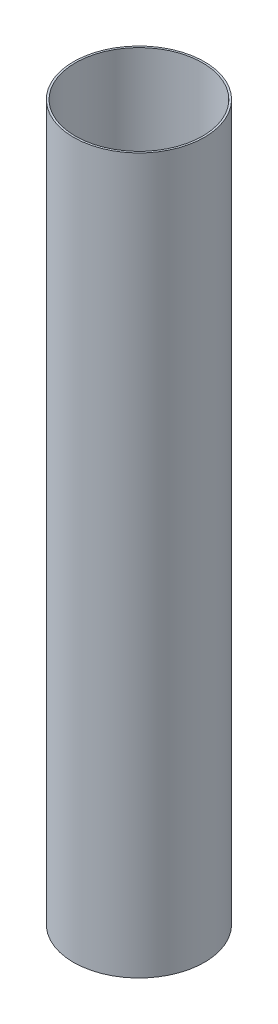
ISO-10303-21;
HEADER;
FILE_DESCRIPTION(('STEP AP214'),'2;1');
FILE_NAME('part.step','',(''),(''),'','','');
FILE_SCHEMA(('AUTOMOTIVE_DESIGN { 1 0 10303 214 1 1 1 1 }'));
ENDSEC;
DATA;
#1=APPLICATION_CONTEXT('core data for automotive mechanical design processes');
#2=APPLICATION_PROTOCOL_DEFINITION('international standard','automotive_design',2000,#1);
#3=PRODUCT_CONTEXT('',#1,'mechanical');
#4=PRODUCT('Part','Part','',(#3));
#5=PRODUCT_RELATED_PRODUCT_CATEGORY('part','',(#4));
#6=PRODUCT_DEFINITION_FORMATION('','',#4);
#7=PRODUCT_DEFINITION_CONTEXT('part definition',#1,'design');
#8=PRODUCT_DEFINITION('design','',#6,#7);
#9=PRODUCT_DEFINITION_SHAPE('','',#8);
#10=(LENGTH_UNIT() NAMED_UNIT(*) SI_UNIT(.MILLI.,.METRE.));
#11=(NAMED_UNIT(*) PLANE_ANGLE_UNIT() SI_UNIT($,.RADIAN.));
#12=(NAMED_UNIT(*) SI_UNIT($,.STERADIAN.) SOLID_ANGLE_UNIT());
#13=UNCERTAINTY_MEASURE_WITH_UNIT(LENGTH_MEASURE(1.E-05),#10,'distance_accuracy_value','');
#14=(GEOMETRIC_REPRESENTATION_CONTEXT(3) GLOBAL_UNCERTAINTY_ASSIGNED_CONTEXT((#13)) GLOBAL_UNIT_ASSIGNED_CONTEXT((#10,
#11,#12)) REPRESENTATION_CONTEXT('',''));
#15=CARTESIAN_POINT('',(0.,0.,0.));
#16=DIRECTION('',(0.,0.,1.));
#17=DIRECTION('',(1.,0.,0.));
#18=AXIS2_PLACEMENT_3D('',#15,#16,#17);
#19=CARTESIAN_POINT('',(0.,600.,0.));
#20=DIRECTION('',(0.,1.,0.));
#21=DIRECTION('',(0.,0.,1.));
#22=AXIS2_PLACEMENT_3D('',#19,#20,#21);
#23=PLANE('',#22);
#24=CARTESIAN_POINT('',(0.,600.,0.));
#25=DIRECTION('',(0.,1.,0.));
#26=DIRECTION('',(0.,0.,1.));
#27=AXIS2_PLACEMENT_3D('',#24,#25,#26);
#28=CIRCLE('',#27,55.);
#29=CARTESIAN_POINT('',(0.,600.,55.));
#30=VERTEX_POINT('',#29);
#31=EDGE_CURVE('E10',#30,#30,#28,.T.);
#32=ORIENTED_EDGE('',*,*,#31,.T.);
#33=EDGE_LOOP('',(#32));
#34=FACE_BOUND('',#33,.T.);
#35=CARTESIAN_POINT('',(0.,600.,0.));
#36=DIRECTION('',(0.,1.,0.));
#37=DIRECTION('',(0.,0.,1.));
#38=AXIS2_PLACEMENT_3D('',#35,#36,#37);
#39=CIRCLE('',#38,53.4);
#40=CARTESIAN_POINT('',(0.,600.,53.4));
#41=VERTEX_POINT('',#40);
#42=EDGE_CURVE('E42',#41,#41,#39,.T.);
#43=ORIENTED_EDGE('',*,*,#42,.F.);
#44=EDGE_LOOP('',(#43));
#45=FACE_BOUND('',#44,.T.);
#46=ADVANCED_FACE('F31',(#34,#45),#23,.T.);
#47=CARTESIAN_POINT('',(0.,0.,0.));
#48=DIRECTION('',(0.,1.,0.));
#49=DIRECTION('',(0.,0.,1.));
#50=AXIS2_PLACEMENT_3D('',#47,#48,#49);
#51=PLANE('',#50);
#52=CARTESIAN_POINT('',(0.,0.,0.));
#53=DIRECTION('',(0.,1.,0.));
#54=DIRECTION('',(0.,0.,1.));
#55=AXIS2_PLACEMENT_3D('',#52,#53,#54);
#56=CIRCLE('',#55,55.);
#57=CARTESIAN_POINT('',(0.,0.,55.));
#58=VERTEX_POINT('',#57);
#59=EDGE_CURVE('E35',#58,#58,#56,.T.);
#60=ORIENTED_EDGE('',*,*,#59,.F.);
#61=EDGE_LOOP('',(#60));
#62=FACE_BOUND('',#61,.T.);
#63=CARTESIAN_POINT('',(0.,0.,0.));
#64=DIRECTION('',(0.,1.,0.));
#65=DIRECTION('',(0.,0.,1.));
#66=AXIS2_PLACEMENT_3D('',#63,#64,#65);
#67=CIRCLE('',#66,53.4);
#68=CARTESIAN_POINT('',(0.,0.,53.4));
#69=VERTEX_POINT('',#68);
#70=EDGE_CURVE('E44',#69,#69,#67,.T.);
#71=ORIENTED_EDGE('',*,*,#70,.T.);
#72=EDGE_LOOP('',(#71));
#73=FACE_BOUND('',#72,.T.);
#74=ADVANCED_FACE('F54',(#62,#73),#51,.F.);
#75=CARTESIAN_POINT('',(0.,600.,0.));
#76=DIRECTION('',(0.,-1.,0.));
#77=DIRECTION('',(0.,0.,-1.));
#78=AXIS2_PLACEMENT_3D('',#75,#76,#77);
#79=CYLINDRICAL_SURFACE('',#78,55.);
#80=ORIENTED_EDGE('',*,*,#31,.F.);
#81=EDGE_LOOP('',(#80));
#82=FACE_BOUND('',#81,.T.);
#83=ORIENTED_EDGE('',*,*,#59,.T.);
#84=EDGE_LOOP('',(#83));
#85=FACE_BOUND('',#84,.T.);
#86=ADVANCED_FACE('F33',(#82,#85),#79,.T.);
#87=CARTESIAN_POINT('',(0.,600.,0.));
#88=DIRECTION('',(0.,-1.,0.));
#89=DIRECTION('',(0.,0.,-1.));
#90=AXIS2_PLACEMENT_3D('',#87,#88,#89);
#91=CYLINDRICAL_SURFACE('',#90,53.4);
#92=ORIENTED_EDGE('',*,*,#42,.T.);
#93=EDGE_LOOP('',(#92));
#94=FACE_BOUND('',#93,.T.);
#95=ORIENTED_EDGE('',*,*,#70,.F.);
#96=EDGE_LOOP('',(#95));
#97=FACE_BOUND('',#96,.T.);
#98=ADVANCED_FACE('F50',(#94,#97),#91,.F.);
#99=CLOSED_SHELL('',(#46,#74,#86,#98));
#100=MANIFOLD_SOLID_BREP('B2',#99);
#101=ADVANCED_BREP_SHAPE_REPRESENTATION('',(#18,#100),#14);
#102=SHAPE_DEFINITION_REPRESENTATION(#9,#101);
ENDSEC;
END-ISO-10303-21;
